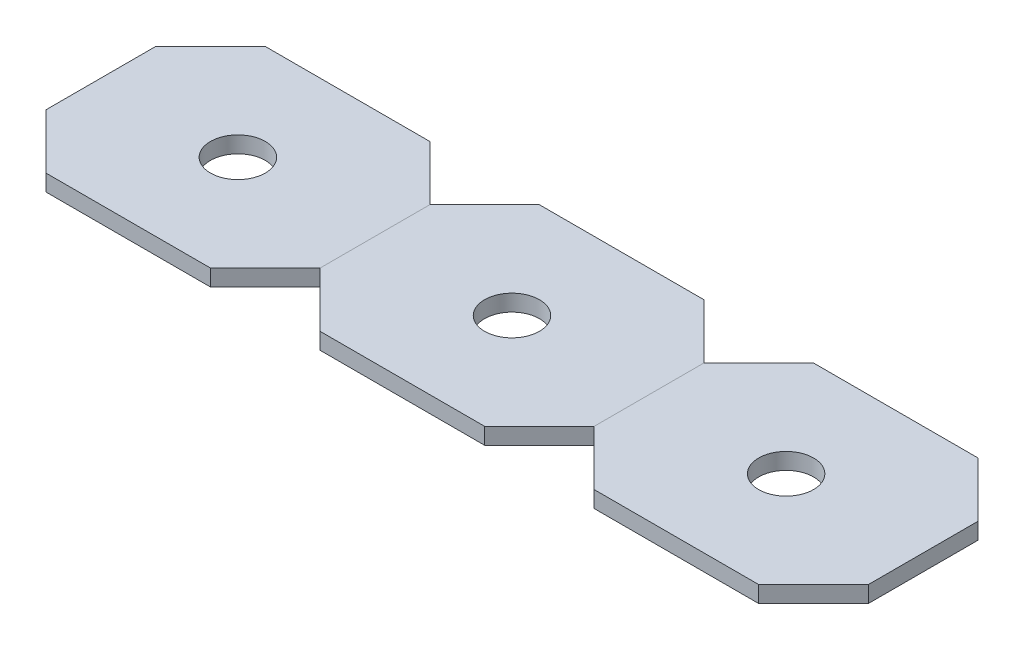
ISO-10303-21;
HEADER;
FILE_DESCRIPTION(('STEP AP214'),'2;1');
FILE_NAME('part.step','',(''),(''),'','','');
FILE_SCHEMA(('AUTOMOTIVE_DESIGN { 1 0 10303 214 1 1 1 1 }'));
ENDSEC;
DATA;
#1=APPLICATION_CONTEXT('core data for automotive mechanical design processes');
#2=APPLICATION_PROTOCOL_DEFINITION('international standard','automotive_design',2000,#1);
#3=PRODUCT_CONTEXT('',#1,'mechanical');
#4=PRODUCT('Part','Part','',(#3));
#5=PRODUCT_RELATED_PRODUCT_CATEGORY('part','',(#4));
#6=PRODUCT_DEFINITION_FORMATION('','',#4);
#7=PRODUCT_DEFINITION_CONTEXT('part definition',#1,'design');
#8=PRODUCT_DEFINITION('design','',#6,#7);
#9=PRODUCT_DEFINITION_SHAPE('','',#8);
#10=(LENGTH_UNIT() NAMED_UNIT(*) SI_UNIT(.MILLI.,.METRE.));
#11=(NAMED_UNIT(*) PLANE_ANGLE_UNIT() SI_UNIT($,.RADIAN.));
#12=(NAMED_UNIT(*) SI_UNIT($,.STERADIAN.) SOLID_ANGLE_UNIT());
#13=UNCERTAINTY_MEASURE_WITH_UNIT(LENGTH_MEASURE(1.E-05),#10,'distance_accuracy_value','');
#14=(GEOMETRIC_REPRESENTATION_CONTEXT(3) GLOBAL_UNCERTAINTY_ASSIGNED_CONTEXT((#13)) GLOBAL_UNIT_ASSIGNED_CONTEXT((#10,
#11,#12)) REPRESENTATION_CONTEXT('',''));
#15=CARTESIAN_POINT('',(0.,0.,0.));
#16=DIRECTION('',(0.,0.,1.));
#17=DIRECTION('',(1.,0.,0.));
#18=AXIS2_PLACEMENT_3D('',#15,#16,#17);
#19=CARTESIAN_POINT('',(22.5290447048375,11.8397547809117,14.1319441751472));
#20=DIRECTION('',(0.707106781186549,0.,-0.707106781186546));
#21=DIRECTION('',(-0.707106781186546,0.,-0.707106781186549));
#22=AXIS2_PLACEMENT_3D('',#19,#20,#21);
#23=PLANE('',#22);
#24=DIRECTION('',(-0.707106781186546,0.,-0.707106781186549));
#25=VECTOR('',#24,1.);
#26=CARTESIAN_POINT('',(22.5290447048375,13.3397547809117,14.1319441751472));
#27=LINE('',#26,#25);
#28=CARTESIAN_POINT('',(22.5290447048375,13.3397547809117,14.1319441751472));
#29=VERTEX_POINT('',#28);
#30=CARTESIAN_POINT('',(17.5290447048375,13.3397547809117,9.13194417514717));
#31=VERTEX_POINT('',#30);
#32=EDGE_CURVE('P0_E141',#29,#31,#27,.T.);
#33=ORIENTED_EDGE('',*,*,#32,.F.);
#34=DIRECTION('',(0.,1.,0.));
#35=VECTOR('',#34,1.);
#36=CARTESIAN_POINT('',(22.5290447048375,11.8397547809117,14.1319441751472));
#37=LINE('',#36,#35);
#38=CARTESIAN_POINT('',(22.5290447048375,11.8397547809117,14.1319441751472));
#39=VERTEX_POINT('',#38);
#40=EDGE_CURVE('P0_E13',#39,#29,#37,.T.);
#41=ORIENTED_EDGE('',*,*,#40,.F.);
#42=DIRECTION('',(-0.707106781186546,0.,-0.707106781186549));
#43=VECTOR('',#42,1.);
#44=CARTESIAN_POINT('',(22.5290447048375,11.8397547809117,14.1319441751472));
#45=LINE('',#44,#43);
#46=CARTESIAN_POINT('',(17.5290447048375,11.8397547809117,9.13194417514717));
#47=VERTEX_POINT('',#46);
#48=EDGE_CURVE('P0_E162',#39,#47,#45,.T.);
#49=ORIENTED_EDGE('',*,*,#48,.T.);
#50=DIRECTION('',(0.,1.,0.));
#51=VECTOR('',#50,1.);
#52=CARTESIAN_POINT('',(17.5290447048375,11.8397547809117,9.13194417514717));
#53=LINE('',#52,#51);
#54=EDGE_CURVE('P0_E47',#47,#31,#53,.T.);
#55=ORIENTED_EDGE('',*,*,#54,.T.);
#56=EDGE_LOOP('',(#33,#41,#49,#55));
#57=FACE_BOUND('',#56,.T.);
#58=ADVANCED_FACE('P0_F44',(#57),#23,.T.);
#59=CARTESIAN_POINT('',(22.5290447048375,11.8397547809117,24.1319441751472));
#60=DIRECTION('',(1.,0.,0.));
#61=DIRECTION('',(0.,0.,-1.));
#62=AXIS2_PLACEMENT_3D('',#59,#60,#61);
#63=PLANE('',#62);
#64=DIRECTION('',(0.,0.,-1.));
#65=VECTOR('',#64,1.);
#66=CARTESIAN_POINT('',(22.5290447048375,13.3397547809117,24.1319441751472));
#67=LINE('',#66,#65);
#68=CARTESIAN_POINT('',(22.5290447048375,13.3397547809117,24.1319441751472));
#69=VERTEX_POINT('',#68);
#70=EDGE_CURVE('P0_E160',#69,#29,#67,.T.);
#71=ORIENTED_EDGE('',*,*,#70,.F.);
#72=DIRECTION('',(0.,1.,0.));
#73=VECTOR('',#72,1.);
#74=CARTESIAN_POINT('',(22.5290447048375,11.8397547809117,24.1319441751472));
#75=LINE('',#74,#73);
#76=CARTESIAN_POINT('',(22.5290447048375,11.8397547809117,24.1319441751472));
#77=VERTEX_POINT('',#76);
#78=EDGE_CURVE('P0_E53',#77,#69,#75,.T.);
#79=ORIENTED_EDGE('',*,*,#78,.F.);
#80=DIRECTION('',(0.,0.,-1.));
#81=VECTOR('',#80,1.);
#82=CARTESIAN_POINT('',(22.5290447048375,11.8397547809117,24.1319441751472));
#83=LINE('',#82,#81);
#84=EDGE_CURVE('P0_E131',#77,#39,#83,.T.);
#85=ORIENTED_EDGE('',*,*,#84,.T.);
#86=ORIENTED_EDGE('',*,*,#40,.T.);
#87=EDGE_LOOP('',(#71,#79,#85,#86));
#88=FACE_BOUND('',#87,.T.);
#89=ADVANCED_FACE('P0_F174',(#88),#63,.T.);
#90=CARTESIAN_POINT('',(17.5290447048375,11.8397547809117,29.1319441751472));
#91=DIRECTION('',(0.707106781186546,0.,0.707106781186549));
#92=DIRECTION('',(0.707106781186549,0.,-0.707106781186546));
#93=AXIS2_PLACEMENT_3D('',#90,#91,#92);
#94=PLANE('',#93);
#95=DIRECTION('',(0.707106781186549,0.,-0.707106781186546));
#96=VECTOR('',#95,1.);
#97=CARTESIAN_POINT('',(17.5290447048375,13.3397547809117,29.1319441751472));
#98=LINE('',#97,#96);
#99=CARTESIAN_POINT('',(17.5290447048375,13.3397547809117,29.1319441751472));
#100=VERTEX_POINT('',#99);
#101=EDGE_CURVE('P0_E118',#100,#69,#98,.T.);
#102=ORIENTED_EDGE('',*,*,#101,.F.);
#103=DIRECTION('',(0.,1.,0.));
#104=VECTOR('',#103,1.);
#105=CARTESIAN_POINT('',(17.5290447048375,11.8397547809117,29.1319441751472));
#106=LINE('',#105,#104);
#107=CARTESIAN_POINT('',(17.5290447048375,11.8397547809117,29.1319441751472));
#108=VERTEX_POINT('',#107);
#109=EDGE_CURVE('P0_E113',#108,#100,#106,.T.);
#110=ORIENTED_EDGE('',*,*,#109,.F.);
#111=DIRECTION('',(0.707106781186549,0.,-0.707106781186546));
#112=VECTOR('',#111,1.);
#113=CARTESIAN_POINT('',(17.5290447048375,11.8397547809117,29.1319441751472));
#114=LINE('',#113,#112);
#115=EDGE_CURVE('P0_E116',#108,#77,#114,.T.);
#116=ORIENTED_EDGE('',*,*,#115,.T.);
#117=ORIENTED_EDGE('',*,*,#78,.T.);
#118=EDGE_LOOP('',(#102,#110,#116,#117));
#119=FACE_BOUND('',#118,.T.);
#120=ADVANCED_FACE('P0_F115',(#119),#94,.T.);
#121=CARTESIAN_POINT('',(2.52904470483748,11.8397547809117,29.1319441751472));
#122=DIRECTION('',(0.,0.,1.));
#123=DIRECTION('',(1.,0.,0.));
#124=AXIS2_PLACEMENT_3D('',#121,#122,#123);
#125=PLANE('',#124);
#126=DIRECTION('',(1.,0.,0.));
#127=VECTOR('',#126,1.);
#128=CARTESIAN_POINT('',(2.52904470483748,13.3397547809117,29.1319441751472));
#129=LINE('',#128,#127);
#130=CARTESIAN_POINT('',(2.52904470483748,13.3397547809117,29.1319441751472));
#131=VERTEX_POINT('',#130);
#132=EDGE_CURVE('P0_E157',#131,#100,#129,.T.);
#133=ORIENTED_EDGE('',*,*,#132,.F.);
#134=DIRECTION('',(0.,1.,0.));
#135=VECTOR('',#134,1.);
#136=CARTESIAN_POINT('',(2.52904470483748,11.8397547809117,29.1319441751472));
#137=LINE('',#136,#135);
#138=CARTESIAN_POINT('',(2.52904470483748,11.8397547809117,29.1319441751472));
#139=VERTEX_POINT('',#138);
#140=EDGE_CURVE('P0_E123',#139,#131,#137,.T.);
#141=ORIENTED_EDGE('',*,*,#140,.F.);
#142=DIRECTION('',(1.,0.,0.));
#143=VECTOR('',#142,1.);
#144=CARTESIAN_POINT('',(2.52904470483748,11.8397547809117,29.1319441751472));
#145=LINE('',#144,#143);
#146=EDGE_CURVE('P0_E129',#139,#108,#145,.T.);
#147=ORIENTED_EDGE('',*,*,#146,.T.);
#148=ORIENTED_EDGE('',*,*,#109,.T.);
#149=EDGE_LOOP('',(#133,#141,#147,#148));
#150=FACE_BOUND('',#149,.T.);
#151=ADVANCED_FACE('P0_F133',(#150),#125,.T.);
#152=CARTESIAN_POINT('',(-2.47095529516251,11.8397547809117,24.1319441751472));
#153=DIRECTION('',(-0.707106781186549,0.,0.707106781186546));
#154=DIRECTION('',(0.707106781186546,0.,0.707106781186549));
#155=AXIS2_PLACEMENT_3D('',#152,#153,#154);
#156=PLANE('',#155);
#157=DIRECTION('',(0.707106781186546,0.,0.707106781186549));
#158=VECTOR('',#157,1.);
#159=CARTESIAN_POINT('',(-2.47095529516251,13.3397547809117,24.1319441751472));
#160=LINE('',#159,#158);
#161=CARTESIAN_POINT('',(-2.47095529516251,13.3397547809117,24.1319441751472));
#162=VERTEX_POINT('',#161);
#163=EDGE_CURVE('P0_E154',#162,#131,#160,.T.);
#164=ORIENTED_EDGE('',*,*,#163,.F.);
#165=DIRECTION('',(0.,1.,0.));
#166=VECTOR('',#165,1.);
#167=CARTESIAN_POINT('',(-2.47095529516251,11.8397547809117,24.1319441751472));
#168=LINE('',#167,#166);
#169=CARTESIAN_POINT('',(-2.47095529516251,11.8397547809117,24.1319441751472));
#170=VERTEX_POINT('',#169);
#171=EDGE_CURVE('P0_E166',#170,#162,#168,.T.);
#172=ORIENTED_EDGE('',*,*,#171,.F.);
#173=DIRECTION('',(0.707106781186546,0.,0.707106781186549));
#174=VECTOR('',#173,1.);
#175=CARTESIAN_POINT('',(-2.47095529516251,11.8397547809117,24.1319441751472));
#176=LINE('',#175,#174);
#177=EDGE_CURVE('P0_E134',#170,#139,#176,.T.);
#178=ORIENTED_EDGE('',*,*,#177,.T.);
#179=ORIENTED_EDGE('',*,*,#140,.T.);
#180=EDGE_LOOP('',(#164,#172,#178,#179));
#181=FACE_BOUND('',#180,.T.);
#182=ADVANCED_FACE('P0_F187',(#181),#156,.T.);
#183=CARTESIAN_POINT('',(-2.47095529516252,11.8397547809117,14.1319441751472));
#184=DIRECTION('',(-1.,0.,0.));
#185=DIRECTION('',(0.,0.,1.));
#186=AXIS2_PLACEMENT_3D('',#183,#184,#185);
#187=PLANE('',#186);
#188=DIRECTION('',(0.,0.,1.));
#189=VECTOR('',#188,1.);
#190=CARTESIAN_POINT('',(-2.47095529516252,13.3397547809117,14.1319441751472));
#191=LINE('',#190,#189);
#192=CARTESIAN_POINT('',(-2.47095529516252,13.3397547809117,14.1319441751472));
#193=VERTEX_POINT('',#192);
#194=EDGE_CURVE('P0_E151',#193,#162,#191,.T.);
#195=ORIENTED_EDGE('',*,*,#194,.F.);
#196=DIRECTION('',(0.,1.,0.));
#197=VECTOR('',#196,1.);
#198=CARTESIAN_POINT('',(-2.47095529516252,11.8397547809117,14.1319441751472));
#199=LINE('',#198,#197);
#200=CARTESIAN_POINT('',(-2.47095529516252,11.8397547809117,14.1319441751472));
#201=VERTEX_POINT('',#200);
#202=EDGE_CURVE('P0_E168',#201,#193,#199,.T.);
#203=ORIENTED_EDGE('',*,*,#202,.F.);
#204=DIRECTION('',(0.,0.,1.));
#205=VECTOR('',#204,1.);
#206=CARTESIAN_POINT('',(-2.47095529516252,11.8397547809117,14.1319441751472));
#207=LINE('',#206,#205);
#208=EDGE_CURVE('P0_E136',#201,#170,#207,.T.);
#209=ORIENTED_EDGE('',*,*,#208,.T.);
#210=ORIENTED_EDGE('',*,*,#171,.T.);
#211=EDGE_LOOP('',(#195,#203,#209,#210));
#212=FACE_BOUND('',#211,.T.);
#213=ADVANCED_FACE('P0_F190',(#212),#187,.T.);
#214=CARTESIAN_POINT('',(2.5290447048375,11.8397547809117,9.13194417514717));
#215=DIRECTION('',(-0.707106781186546,0.,-0.707106781186549));
#216=DIRECTION('',(-0.707106781186549,0.,0.707106781186546));
#217=AXIS2_PLACEMENT_3D('',#214,#215,#216);
#218=PLANE('',#217);
#219=DIRECTION('',(-0.707106781186549,0.,0.707106781186546));
#220=VECTOR('',#219,1.);
#221=CARTESIAN_POINT('',(2.5290447048375,13.3397547809117,9.13194417514717));
#222=LINE('',#221,#220);
#223=CARTESIAN_POINT('',(2.5290447048375,13.3397547809117,9.13194417514717));
#224=VERTEX_POINT('',#223);
#225=EDGE_CURVE('P0_E148',#224,#193,#222,.T.);
#226=ORIENTED_EDGE('',*,*,#225,.F.);
#227=DIRECTION('',(0.,1.,0.));
#228=VECTOR('',#227,1.);
#229=CARTESIAN_POINT('',(2.5290447048375,11.8397547809117,9.13194417514717));
#230=LINE('',#229,#228);
#231=CARTESIAN_POINT('',(2.5290447048375,11.8397547809117,9.13194417514717));
#232=VERTEX_POINT('',#231);
#233=EDGE_CURVE('P0_E169',#232,#224,#230,.T.);
#234=ORIENTED_EDGE('',*,*,#233,.F.);
#235=DIRECTION('',(-0.707106781186549,0.,0.707106781186546));
#236=VECTOR('',#235,1.);
#237=CARTESIAN_POINT('',(2.5290447048375,11.8397547809117,9.13194417514717));
#238=LINE('',#237,#236);
#239=EDGE_CURVE('P0_E225',#232,#201,#238,.T.);
#240=ORIENTED_EDGE('',*,*,#239,.T.);
#241=ORIENTED_EDGE('',*,*,#202,.T.);
#242=EDGE_LOOP('',(#226,#234,#240,#241));
#243=FACE_BOUND('',#242,.T.);
#244=ADVANCED_FACE('P0_F194',(#243),#218,.T.);
#245=CARTESIAN_POINT('',(17.5290447048375,11.8397547809117,9.13194417514717));
#246=DIRECTION('',(0.,0.,-1.));
#247=DIRECTION('',(-1.,0.,0.));
#248=AXIS2_PLACEMENT_3D('',#245,#246,#247);
#249=PLANE('',#248);
#250=DIRECTION('',(-1.,0.,0.));
#251=VECTOR('',#250,1.);
#252=CARTESIAN_POINT('',(17.5290447048375,13.3397547809117,9.13194417514717));
#253=LINE('',#252,#251);
#254=EDGE_CURVE('P0_E144',#31,#224,#253,.T.);
#255=ORIENTED_EDGE('',*,*,#254,.F.);
#256=ORIENTED_EDGE('',*,*,#54,.F.);
#257=DIRECTION('',(-1.,0.,0.));
#258=VECTOR('',#257,1.);
#259=CARTESIAN_POINT('',(17.5290447048375,11.8397547809117,9.13194417514717));
#260=LINE('',#259,#258);
#261=EDGE_CURVE('P0_E223',#47,#232,#260,.T.);
#262=ORIENTED_EDGE('',*,*,#261,.T.);
#263=ORIENTED_EDGE('',*,*,#233,.T.);
#264=EDGE_LOOP('',(#255,#256,#262,#263));
#265=FACE_BOUND('',#264,.T.);
#266=ADVANCED_FACE('P0_F171',(#265),#249,.T.);
#267=CARTESIAN_POINT('',(0.,11.8397547809117,0.));
#268=DIRECTION('',(0.,1.,0.));
#269=DIRECTION('',(0.,0.,1.));
#270=AXIS2_PLACEMENT_3D('',#267,#268,#269);
#271=PLANE('',#270);
#272=CARTESIAN_POINT('',(10.0290447048375,11.8397547809117,19.1319441751472));
#273=DIRECTION('',(0.,1.,0.));
#274=DIRECTION('',(0.,0.,-1.));
#275=AXIS2_PLACEMENT_3D('',#272,#273,#274);
#276=CIRCLE('',#275,2.5);
#277=CARTESIAN_POINT('',(10.0290447048375,11.8397547809117,16.6319441751472));
#278=VERTEX_POINT('',#277);
#279=EDGE_CURVE('P0_E145',#278,#278,#276,.T.);
#280=ORIENTED_EDGE('',*,*,#279,.T.);
#281=EDGE_LOOP('',(#280));
#282=FACE_BOUND('',#281,.T.);
#283=ORIENTED_EDGE('',*,*,#48,.F.);
#284=ORIENTED_EDGE('',*,*,#84,.F.);
#285=ORIENTED_EDGE('',*,*,#115,.F.);
#286=ORIENTED_EDGE('',*,*,#146,.F.);
#287=ORIENTED_EDGE('',*,*,#177,.F.);
#288=ORIENTED_EDGE('',*,*,#208,.F.);
#289=ORIENTED_EDGE('',*,*,#239,.F.);
#290=ORIENTED_EDGE('',*,*,#261,.F.);
#291=EDGE_LOOP('',(#283,#284,#285,#286,#287,#288,#289,#290));
#292=FACE_BOUND('',#291,.T.);
#293=ADVANCED_FACE('P0_F127',(#282,#292),#271,.F.);
#294=CARTESIAN_POINT('',(0.,13.3397547809117,0.));
#295=DIRECTION('',(0.,1.,0.));
#296=DIRECTION('',(0.,0.,1.));
#297=AXIS2_PLACEMENT_3D('',#294,#295,#296);
#298=PLANE('',#297);
#299=CARTESIAN_POINT('',(10.0290447048375,13.3397547809117,19.1319441751472));
#300=DIRECTION('',(0.,1.,0.));
#301=DIRECTION('',(0.,0.,-1.));
#302=AXIS2_PLACEMENT_3D('',#299,#300,#301);
#303=CIRCLE('',#302,2.5);
#304=CARTESIAN_POINT('',(10.0290447048375,13.3397547809117,16.6319441751472));
#305=VERTEX_POINT('',#304);
#306=EDGE_CURVE('P0_E218',#305,#305,#303,.T.);
#307=ORIENTED_EDGE('',*,*,#306,.F.);
#308=EDGE_LOOP('',(#307));
#309=FACE_BOUND('',#308,.T.);
#310=ORIENTED_EDGE('',*,*,#32,.T.);
#311=ORIENTED_EDGE('',*,*,#254,.T.);
#312=ORIENTED_EDGE('',*,*,#225,.T.);
#313=ORIENTED_EDGE('',*,*,#194,.T.);
#314=ORIENTED_EDGE('',*,*,#163,.T.);
#315=ORIENTED_EDGE('',*,*,#132,.T.);
#316=ORIENTED_EDGE('',*,*,#101,.T.);
#317=ORIENTED_EDGE('',*,*,#70,.T.);
#318=EDGE_LOOP('',(#310,#311,#312,#313,#314,#315,#316,#317));
#319=FACE_BOUND('',#318,.T.);
#320=ADVANCED_FACE('P0_F173',(#309,#319),#298,.T.);
#321=CARTESIAN_POINT('',(10.0290447048375,11.8397547809117,19.1319441751472));
#322=DIRECTION('',(0.,1.,0.));
#323=DIRECTION('',(0.,0.,1.));
#324=AXIS2_PLACEMENT_3D('',#321,#322,#323);
#325=CYLINDRICAL_SURFACE('',#324,2.5);
#326=ORIENTED_EDGE('',*,*,#279,.F.);
#327=EDGE_LOOP('',(#326));
#328=FACE_BOUND('',#327,.T.);
#329=ORIENTED_EDGE('',*,*,#306,.T.);
#330=EDGE_LOOP('',(#329));
#331=FACE_BOUND('',#330,.T.);
#332=ADVANCED_FACE('P0_F206',(#328,#331),#325,.F.);
#333=CLOSED_SHELL('',(#58,#89,#120,#151,#182,#213,#244,#266,#293,#320,#332));
#334=MANIFOLD_SOLID_BREP('P0_B2',#333);
#335=CARTESIAN_POINT('',(-2.47095529516251,13.3397547809117,9.13194417514716));
#336=DIRECTION('',(-1.,0.,0.));
#337=DIRECTION('',(0.,0.,1.));
#338=AXIS2_PLACEMENT_3D('',#335,#336,#337);
#339=PLANE('',#338);
#340=DIRECTION('',(0.,0.,-1.));
#341=VECTOR('',#340,1.);
#342=CARTESIAN_POINT('',(-2.47095529516251,11.8397547809117,9.13194417514716));
#343=LINE('',#342,#341);
#344=CARTESIAN_POINT('',(-2.47095529516251,11.8397547809117,24.1319441751472));
#345=VERTEX_POINT('',#344);
#346=CARTESIAN_POINT('',(-2.47095529516251,11.8397547809117,14.1319441751472));
#347=VERTEX_POINT('',#346);
#348=EDGE_CURVE('P1_E111',#345,#347,#343,.T.);
#349=ORIENTED_EDGE('',*,*,#348,.T.);
#350=DIRECTION('',(0.,1.,0.));
#351=VECTOR('',#350,1.);
#352=CARTESIAN_POINT('',(-2.47095529516251,13.3397547809117,14.1319441751472));
#353=LINE('',#352,#351);
#354=CARTESIAN_POINT('',(-2.47095529516251,13.3397547809117,14.1319441751472));
#355=VERTEX_POINT('',#354);
#356=EDGE_CURVE('P1_E134',#347,#355,#353,.T.);
#357=ORIENTED_EDGE('',*,*,#356,.T.);
#358=DIRECTION('',(0.,0.,-1.));
#359=VECTOR('',#358,1.);
#360=CARTESIAN_POINT('',(-2.47095529516251,13.3397547809117,9.13194417514716));
#361=LINE('',#360,#359);
#362=CARTESIAN_POINT('',(-2.47095529516251,13.3397547809117,24.1319441751472));
#363=VERTEX_POINT('',#362);
#364=EDGE_CURVE('P1_E109',#363,#355,#361,.T.);
#365=ORIENTED_EDGE('',*,*,#364,.F.);
#366=DIRECTION('',(0.,-1.,0.));
#367=VECTOR('',#366,1.);
#368=CARTESIAN_POINT('',(-2.47095529516251,13.3397547809117,24.1319441751472));
#369=LINE('',#368,#367);
#370=EDGE_CURVE('P1_E131',#363,#345,#369,.T.);
#371=ORIENTED_EDGE('',*,*,#370,.T.);
#372=EDGE_LOOP('',(#349,#357,#365,#371));
#373=FACE_BOUND('',#372,.T.);
#374=ADVANCED_FACE('P1_F16',(#373),#339,.F.);
#375=CARTESIAN_POINT('',(-27.4709552951625,13.3397547809117,9.13194417514716));
#376=DIRECTION('',(0.,0.,1.));
#377=DIRECTION('',(1.,0.,0.));
#378=AXIS2_PLACEMENT_3D('',#375,#376,#377);
#379=PLANE('',#378);
#380=DIRECTION('',(-1.,0.,0.));
#381=VECTOR('',#380,1.);
#382=CARTESIAN_POINT('',(-27.4709552951625,11.8397547809117,9.13194417514716));
#383=LINE('',#382,#381);
#384=CARTESIAN_POINT('',(-7.47095529516251,11.8397547809117,9.13194417514716));
#385=VERTEX_POINT('',#384);
#386=CARTESIAN_POINT('',(-22.4709552951625,11.8397547809117,9.13194417514716));
#387=VERTEX_POINT('',#386);
#388=EDGE_CURVE('P1_E107',#385,#387,#383,.T.);
#389=ORIENTED_EDGE('',*,*,#388,.T.);
#390=DIRECTION('',(0.,1.,0.));
#391=VECTOR('',#390,1.);
#392=CARTESIAN_POINT('',(-22.4709552951625,13.3397547809117,9.13194417514716));
#393=LINE('',#392,#391);
#394=CARTESIAN_POINT('',(-22.4709552951625,13.3397547809117,9.13194417514716));
#395=VERTEX_POINT('',#394);
#396=EDGE_CURVE('P1_E86',#387,#395,#393,.T.);
#397=ORIENTED_EDGE('',*,*,#396,.T.);
#398=DIRECTION('',(-1.,0.,0.));
#399=VECTOR('',#398,1.);
#400=CARTESIAN_POINT('',(-27.4709552951625,13.3397547809117,9.13194417514716));
#401=LINE('',#400,#399);
#402=CARTESIAN_POINT('',(-7.47095529516251,13.3397547809117,9.13194417514716));
#403=VERTEX_POINT('',#402);
#404=EDGE_CURVE('P1_E150',#403,#395,#401,.T.);
#405=ORIENTED_EDGE('',*,*,#404,.F.);
#406=DIRECTION('',(0.,-1.,0.));
#407=VECTOR('',#406,1.);
#408=CARTESIAN_POINT('',(-7.47095529516251,13.3397547809117,9.13194417514716));
#409=LINE('',#408,#407);
#410=EDGE_CURVE('P1_E91',#403,#385,#409,.T.);
#411=ORIENTED_EDGE('',*,*,#410,.T.);
#412=EDGE_LOOP('',(#389,#397,#405,#411));
#413=FACE_BOUND('',#412,.T.);
#414=ADVANCED_FACE('P1_F174',(#413),#379,.F.);
#415=CARTESIAN_POINT('',(-27.4709552951625,13.3397547809117,9.13194417514716));
#416=DIRECTION('',(1.,0.,0.));
#417=DIRECTION('',(0.,0.,-1.));
#418=AXIS2_PLACEMENT_3D('',#415,#416,#417);
#419=PLANE('',#418);
#420=DIRECTION('',(0.,0.,1.));
#421=VECTOR('',#420,1.);
#422=CARTESIAN_POINT('',(-27.4709552951625,13.3397547809117,9.13194417514716));
#423=LINE('',#422,#421);
#424=CARTESIAN_POINT('',(-27.4709552951625,13.3397547809117,14.1319441751472));
#425=VERTEX_POINT('',#424);
#426=CARTESIAN_POINT('',(-27.4709552951625,13.3397547809117,24.1319441751472));
#427=VERTEX_POINT('',#426);
#428=EDGE_CURVE('P1_E100',#425,#427,#423,.T.);
#429=ORIENTED_EDGE('',*,*,#428,.F.);
#430=DIRECTION('',(0.,-1.,0.));
#431=VECTOR('',#430,1.);
#432=CARTESIAN_POINT('',(-27.4709552951625,13.3397547809117,14.1319441751472));
#433=LINE('',#432,#431);
#434=CARTESIAN_POINT('',(-27.4709552951625,11.8397547809117,14.1319441751472));
#435=VERTEX_POINT('',#434);
#436=EDGE_CURVE('P1_E85',#425,#435,#433,.T.);
#437=ORIENTED_EDGE('',*,*,#436,.T.);
#438=DIRECTION('',(0.,0.,1.));
#439=VECTOR('',#438,1.);
#440=CARTESIAN_POINT('',(-27.4709552951625,11.8397547809117,9.13194417514716));
#441=LINE('',#440,#439);
#442=CARTESIAN_POINT('',(-27.4709552951625,11.8397547809117,24.1319441751472));
#443=VERTEX_POINT('',#442);
#444=EDGE_CURVE('P1_E98',#435,#443,#441,.T.);
#445=ORIENTED_EDGE('',*,*,#444,.T.);
#446=DIRECTION('',(0.,1.,0.));
#447=VECTOR('',#446,1.);
#448=CARTESIAN_POINT('',(-27.4709552951625,13.3397547809117,24.1319441751472));
#449=LINE('',#448,#447);
#450=EDGE_CURVE('P1_E102',#443,#427,#449,.T.);
#451=ORIENTED_EDGE('',*,*,#450,.T.);
#452=EDGE_LOOP('',(#429,#437,#445,#451));
#453=FACE_BOUND('',#452,.T.);
#454=ADVANCED_FACE('P1_F97',(#453),#419,.F.);
#455=CARTESIAN_POINT('',(-27.4709552951625,13.3397547809117,29.1319441751472));
#456=DIRECTION('',(0.,0.,-1.));
#457=DIRECTION('',(-1.,0.,0.));
#458=AXIS2_PLACEMENT_3D('',#455,#456,#457);
#459=PLANE('',#458);
#460=DIRECTION('',(1.,0.,0.));
#461=VECTOR('',#460,1.);
#462=CARTESIAN_POINT('',(-27.4709552951625,11.8397547809117,29.1319441751472));
#463=LINE('',#462,#461);
#464=CARTESIAN_POINT('',(-22.4709552951625,11.8397547809117,29.1319441751472));
#465=VERTEX_POINT('',#464);
#466=CARTESIAN_POINT('',(-7.47095529516253,11.8397547809117,29.1319441751472));
#467=VERTEX_POINT('',#466);
#468=EDGE_CURVE('P1_E106',#465,#467,#463,.T.);
#469=ORIENTED_EDGE('',*,*,#468,.T.);
#470=DIRECTION('',(0.,1.,0.));
#471=VECTOR('',#470,1.);
#472=CARTESIAN_POINT('',(-7.47095529516253,13.3397547809117,29.1319441751472));
#473=LINE('',#472,#471);
#474=CARTESIAN_POINT('',(-7.47095529516253,13.3397547809117,29.1319441751472));
#475=VERTEX_POINT('',#474);
#476=EDGE_CURVE('P1_E11',#467,#475,#473,.T.);
#477=ORIENTED_EDGE('',*,*,#476,.T.);
#478=DIRECTION('',(1.,0.,0.));
#479=VECTOR('',#478,1.);
#480=CARTESIAN_POINT('',(-27.4709552951625,13.3397547809117,29.1319441751472));
#481=LINE('',#480,#479);
#482=CARTESIAN_POINT('',(-22.4709552951625,13.3397547809117,29.1319441751472));
#483=VERTEX_POINT('',#482);
#484=EDGE_CURVE('P1_E115',#483,#475,#481,.T.);
#485=ORIENTED_EDGE('',*,*,#484,.F.);
#486=DIRECTION('',(0.,-1.,0.));
#487=VECTOR('',#486,1.);
#488=CARTESIAN_POINT('',(-22.4709552951625,13.3397547809117,29.1319441751472));
#489=LINE('',#488,#487);
#490=EDGE_CURVE('P1_E24',#483,#465,#489,.T.);
#491=ORIENTED_EDGE('',*,*,#490,.T.);
#492=EDGE_LOOP('',(#469,#477,#485,#491));
#493=FACE_BOUND('',#492,.T.);
#494=ADVANCED_FACE('P1_F137',(#493),#459,.F.);
#495=CARTESIAN_POINT('',(-14.9709552951625,13.3397547809117,19.1319441751472));
#496=DIRECTION('',(0.,1.,0.));
#497=DIRECTION('',(0.,0.,1.));
#498=AXIS2_PLACEMENT_3D('',#495,#496,#497);
#499=PLANE('',#498);
#500=CARTESIAN_POINT('',(-14.9709552951625,13.3397547809117,19.1319441751472));
#501=DIRECTION('',(0.,1.,0.));
#502=DIRECTION('',(0.,0.,1.));
#503=AXIS2_PLACEMENT_3D('',#500,#501,#502);
#504=CIRCLE('',#503,2.5);
#505=CARTESIAN_POINT('',(-14.9709552951625,13.3397547809117,21.6319441751472));
#506=VERTEX_POINT('',#505);
#507=EDGE_CURVE('P1_E155',#506,#506,#504,.T.);
#508=ORIENTED_EDGE('',*,*,#507,.F.);
#509=EDGE_LOOP('',(#508));
#510=FACE_BOUND('',#509,.T.);
#511=ORIENTED_EDGE('',*,*,#404,.T.);
#512=DIRECTION('',(0.707106781186549,0.,-0.707106781186546));
#513=VECTOR('',#512,1.);
#514=CARTESIAN_POINT('',(-23.7209552951625,13.3397547809117,10.3819441751471));
#515=LINE('',#514,#513);
#516=EDGE_CURVE('P1_E129',#395,#425,#515,.F.);
#517=ORIENTED_EDGE('',*,*,#516,.T.);
#518=ORIENTED_EDGE('',*,*,#428,.T.);
#519=DIRECTION('',(-0.707106781186546,0.,-0.707106781186549));
#520=VECTOR('',#519,1.);
#521=CARTESIAN_POINT('',(-23.7209552951625,13.3397547809117,27.8819441751472));
#522=LINE('',#521,#520);
#523=EDGE_CURVE('P1_E36',#427,#483,#522,.F.);
#524=ORIENTED_EDGE('',*,*,#523,.T.);
#525=ORIENTED_EDGE('',*,*,#484,.T.);
#526=DIRECTION('',(-0.707106781186549,0.,0.707106781186546));
#527=VECTOR('',#526,1.);
#528=CARTESIAN_POINT('',(-6.22095529516254,13.3397547809117,27.8819441751472));
#529=LINE('',#528,#527);
#530=EDGE_CURVE('P1_E125',#475,#363,#529,.F.);
#531=ORIENTED_EDGE('',*,*,#530,.T.);
#532=ORIENTED_EDGE('',*,*,#364,.T.);
#533=DIRECTION('',(0.707106781186546,0.,0.707106781186549));
#534=VECTOR('',#533,1.);
#535=CARTESIAN_POINT('',(-6.22095529516249,13.3397547809117,10.3819441751472));
#536=LINE('',#535,#534);
#537=EDGE_CURVE('P1_E127',#355,#403,#536,.F.);
#538=ORIENTED_EDGE('',*,*,#537,.T.);
#539=EDGE_LOOP('',(#511,#517,#518,#524,#525,#531,#532,#538));
#540=FACE_BOUND('',#539,.T.);
#541=ADVANCED_FACE('P1_F168',(#510,#540),#499,.T.);
#542=CARTESIAN_POINT('',(-14.9709552951625,11.8397547809117,19.1319441751472));
#543=DIRECTION('',(0.,1.,0.));
#544=DIRECTION('',(0.,0.,1.));
#545=AXIS2_PLACEMENT_3D('',#542,#543,#544);
#546=PLANE('',#545);
#547=CARTESIAN_POINT('',(-14.9709552951625,11.8397547809117,19.1319441751472));
#548=DIRECTION('',(0.,1.,0.));
#549=DIRECTION('',(0.,0.,1.));
#550=AXIS2_PLACEMENT_3D('',#547,#548,#549);
#551=CIRCLE('',#550,2.5);
#552=CARTESIAN_POINT('',(-14.9709552951625,11.8397547809117,21.6319441751472));
#553=VERTEX_POINT('',#552);
#554=EDGE_CURVE('P1_E159',#553,#553,#551,.T.);
#555=ORIENTED_EDGE('',*,*,#554,.T.);
#556=EDGE_LOOP('',(#555));
#557=FACE_BOUND('',#556,.T.);
#558=ORIENTED_EDGE('',*,*,#444,.F.);
#559=DIRECTION('',(-0.707106781186549,0.,0.707106781186546));
#560=VECTOR('',#559,1.);
#561=CARTESIAN_POINT('',(-27.4709552951625,11.8397547809117,14.1319441751472));
#562=LINE('',#561,#560);
#563=EDGE_CURVE('P1_E81',#435,#387,#562,.F.);
#564=ORIENTED_EDGE('',*,*,#563,.T.);
#565=ORIENTED_EDGE('',*,*,#388,.F.);
#566=DIRECTION('',(-0.707106781186546,0.,-0.707106781186549));
#567=VECTOR('',#566,1.);
#568=CARTESIAN_POINT('',(-7.47095529516251,11.8397547809117,9.13194417514716));
#569=LINE('',#568,#567);
#570=EDGE_CURVE('P1_E92',#385,#347,#569,.F.);
#571=ORIENTED_EDGE('',*,*,#570,.T.);
#572=ORIENTED_EDGE('',*,*,#348,.F.);
#573=DIRECTION('',(0.707106781186549,0.,-0.707106781186546));
#574=VECTOR('',#573,1.);
#575=CARTESIAN_POINT('',(-2.47095529516251,11.8397547809117,24.1319441751472));
#576=LINE('',#575,#574);
#577=EDGE_CURVE('P1_E118',#345,#467,#576,.F.);
#578=ORIENTED_EDGE('',*,*,#577,.T.);
#579=ORIENTED_EDGE('',*,*,#468,.F.);
#580=DIRECTION('',(0.707106781186546,0.,0.707106781186549));
#581=VECTOR('',#580,1.);
#582=CARTESIAN_POINT('',(-22.4709552951625,11.8397547809117,29.1319441751472));
#583=LINE('',#582,#581);
#584=EDGE_CURVE('P1_E101',#465,#443,#583,.F.);
#585=ORIENTED_EDGE('',*,*,#584,.T.);
#586=EDGE_LOOP('',(#558,#564,#565,#571,#572,#578,#579,#585));
#587=FACE_BOUND('',#586,.T.);
#588=ADVANCED_FACE('P1_F104',(#557,#587),#546,.F.);
#589=CARTESIAN_POINT('',(-27.4709552951625,13.3397547809117,14.1319441751472));
#590=DIRECTION('',(0.707106781186546,0.,0.707106781186549));
#591=DIRECTION('',(0.,-1.,0.));
#592=AXIS2_PLACEMENT_3D('',#589,#590,#591);
#593=PLANE('',#592);
#594=ORIENTED_EDGE('',*,*,#516,.F.);
#595=ORIENTED_EDGE('',*,*,#396,.F.);
#596=ORIENTED_EDGE('',*,*,#563,.F.);
#597=ORIENTED_EDGE('',*,*,#436,.F.);
#598=EDGE_LOOP('',(#594,#595,#596,#597));
#599=FACE_BOUND('',#598,.T.);
#600=ADVANCED_FACE('P1_F84',(#599),#593,.F.);
#601=CARTESIAN_POINT('',(-7.47095529516251,13.3397547809117,9.13194417514716));
#602=DIRECTION('',(-0.707106781186549,0.,0.707106781186546));
#603=DIRECTION('',(0.,-1.,0.));
#604=AXIS2_PLACEMENT_3D('',#601,#602,#603);
#605=PLANE('',#604);
#606=ORIENTED_EDGE('',*,*,#537,.F.);
#607=ORIENTED_EDGE('',*,*,#356,.F.);
#608=ORIENTED_EDGE('',*,*,#570,.F.);
#609=ORIENTED_EDGE('',*,*,#410,.F.);
#610=EDGE_LOOP('',(#606,#607,#608,#609));
#611=FACE_BOUND('',#610,.T.);
#612=ADVANCED_FACE('P1_F176',(#611),#605,.F.);
#613=CARTESIAN_POINT('',(-2.47095529516251,13.3397547809117,24.1319441751472));
#614=DIRECTION('',(-0.707106781186546,0.,-0.707106781186549));
#615=DIRECTION('',(0.,-1.,0.));
#616=AXIS2_PLACEMENT_3D('',#613,#614,#615);
#617=PLANE('',#616);
#618=ORIENTED_EDGE('',*,*,#530,.F.);
#619=ORIENTED_EDGE('',*,*,#476,.F.);
#620=ORIENTED_EDGE('',*,*,#577,.F.);
#621=ORIENTED_EDGE('',*,*,#370,.F.);
#622=EDGE_LOOP('',(#618,#619,#620,#621));
#623=FACE_BOUND('',#622,.T.);
#624=ADVANCED_FACE('P1_F144',(#623),#617,.F.);
#625=CARTESIAN_POINT('',(-22.4709552951625,13.3397547809117,29.1319441751472));
#626=DIRECTION('',(0.707106781186549,0.,-0.707106781186546));
#627=DIRECTION('',(0.,-1.,0.));
#628=AXIS2_PLACEMENT_3D('',#625,#626,#627);
#629=PLANE('',#628);
#630=ORIENTED_EDGE('',*,*,#523,.F.);
#631=ORIENTED_EDGE('',*,*,#450,.F.);
#632=ORIENTED_EDGE('',*,*,#584,.F.);
#633=ORIENTED_EDGE('',*,*,#490,.F.);
#634=EDGE_LOOP('',(#630,#631,#632,#633));
#635=FACE_BOUND('',#634,.T.);
#636=ADVANCED_FACE('P1_F18',(#635),#629,.F.);
#637=CARTESIAN_POINT('',(-14.9709552951625,11.8397547809117,19.1319441751472));
#638=DIRECTION('',(0.,1.,0.));
#639=DIRECTION('',(0.,0.,1.));
#640=AXIS2_PLACEMENT_3D('',#637,#638,#639);
#641=CYLINDRICAL_SURFACE('',#640,2.5);
#642=ORIENTED_EDGE('',*,*,#554,.F.);
#643=EDGE_LOOP('',(#642));
#644=FACE_BOUND('',#643,.T.);
#645=ORIENTED_EDGE('',*,*,#507,.T.);
#646=EDGE_LOOP('',(#645));
#647=FACE_BOUND('',#646,.T.);
#648=ADVANCED_FACE('P1_F166',(#644,#647),#641,.F.);
#649=CLOSED_SHELL('',(#374,#414,#454,#494,#541,#588,#600,#612,#624,#636,#648));
#650=MANIFOLD_SOLID_BREP('P1_B1',#649);
#651=CARTESIAN_POINT('',(47.5290447048375,13.3397547809117,9.13194417514717));
#652=DIRECTION('',(-1.,0.,0.));
#653=DIRECTION('',(0.,0.,1.));
#654=AXIS2_PLACEMENT_3D('',#651,#652,#653);
#655=PLANE('',#654);
#656=DIRECTION('',(0.,0.,-1.));
#657=VECTOR('',#656,1.);
#658=CARTESIAN_POINT('',(47.5290447048375,11.8397547809117,9.13194417514717));
#659=LINE('',#658,#657);
#660=CARTESIAN_POINT('',(47.5290447048375,11.8397547809117,24.1319441751472));
#661=VERTEX_POINT('',#660);
#662=CARTESIAN_POINT('',(47.5290447048375,11.8397547809117,14.1319441751472));
#663=VERTEX_POINT('',#662);
#664=EDGE_CURVE('P2_E111',#661,#663,#659,.T.);
#665=ORIENTED_EDGE('',*,*,#664,.T.);
#666=DIRECTION('',(0.,1.,0.));
#667=VECTOR('',#666,1.);
#668=CARTESIAN_POINT('',(47.5290447048375,13.3397547809117,14.1319441751472));
#669=LINE('',#668,#667);
#670=CARTESIAN_POINT('',(47.5290447048375,13.3397547809117,14.1319441751472));
#671=VERTEX_POINT('',#670);
#672=EDGE_CURVE('P2_E134',#663,#671,#669,.T.);
#673=ORIENTED_EDGE('',*,*,#672,.T.);
#674=DIRECTION('',(0.,0.,-1.));
#675=VECTOR('',#674,1.);
#676=CARTESIAN_POINT('',(47.5290447048375,13.3397547809117,9.13194417514717));
#677=LINE('',#676,#675);
#678=CARTESIAN_POINT('',(47.5290447048375,13.3397547809117,24.1319441751472));
#679=VERTEX_POINT('',#678);
#680=EDGE_CURVE('P2_E109',#679,#671,#677,.T.);
#681=ORIENTED_EDGE('',*,*,#680,.F.);
#682=DIRECTION('',(0.,-1.,0.));
#683=VECTOR('',#682,1.);
#684=CARTESIAN_POINT('',(47.5290447048375,13.3397547809117,24.1319441751472));
#685=LINE('',#684,#683);
#686=EDGE_CURVE('P2_E131',#679,#661,#685,.T.);
#687=ORIENTED_EDGE('',*,*,#686,.T.);
#688=EDGE_LOOP('',(#665,#673,#681,#687));
#689=FACE_BOUND('',#688,.T.);
#690=ADVANCED_FACE('P2_F16',(#689),#655,.F.);
#691=CARTESIAN_POINT('',(22.5290447048375,13.3397547809117,9.13194417514717));
#692=DIRECTION('',(0.,0.,1.));
#693=DIRECTION('',(1.,0.,0.));
#694=AXIS2_PLACEMENT_3D('',#691,#692,#693);
#695=PLANE('',#694);
#696=DIRECTION('',(-1.,0.,0.));
#697=VECTOR('',#696,1.);
#698=CARTESIAN_POINT('',(22.5290447048375,11.8397547809117,9.13194417514717));
#699=LINE('',#698,#697);
#700=CARTESIAN_POINT('',(42.5290447048375,11.8397547809117,9.13194417514717));
#701=VERTEX_POINT('',#700);
#702=CARTESIAN_POINT('',(27.5290447048375,11.8397547809117,9.13194417514717));
#703=VERTEX_POINT('',#702);
#704=EDGE_CURVE('P2_E107',#701,#703,#699,.T.);
#705=ORIENTED_EDGE('',*,*,#704,.T.);
#706=DIRECTION('',(0.,1.,0.));
#707=VECTOR('',#706,1.);
#708=CARTESIAN_POINT('',(27.5290447048375,13.3397547809117,9.13194417514717));
#709=LINE('',#708,#707);
#710=CARTESIAN_POINT('',(27.5290447048375,13.3397547809117,9.13194417514717));
#711=VERTEX_POINT('',#710);
#712=EDGE_CURVE('P2_E86',#703,#711,#709,.T.);
#713=ORIENTED_EDGE('',*,*,#712,.T.);
#714=DIRECTION('',(-1.,0.,0.));
#715=VECTOR('',#714,1.);
#716=CARTESIAN_POINT('',(22.5290447048375,13.3397547809117,9.13194417514717));
#717=LINE('',#716,#715);
#718=CARTESIAN_POINT('',(42.5290447048375,13.3397547809117,9.13194417514717));
#719=VERTEX_POINT('',#718);
#720=EDGE_CURVE('P2_E150',#719,#711,#717,.T.);
#721=ORIENTED_EDGE('',*,*,#720,.F.);
#722=DIRECTION('',(0.,-1.,0.));
#723=VECTOR('',#722,1.);
#724=CARTESIAN_POINT('',(42.5290447048375,13.3397547809117,9.13194417514717));
#725=LINE('',#724,#723);
#726=EDGE_CURVE('P2_E91',#719,#701,#725,.T.);
#727=ORIENTED_EDGE('',*,*,#726,.T.);
#728=EDGE_LOOP('',(#705,#713,#721,#727));
#729=FACE_BOUND('',#728,.T.);
#730=ADVANCED_FACE('P2_F174',(#729),#695,.F.);
#731=CARTESIAN_POINT('',(22.5290447048375,13.3397547809117,9.13194417514717));
#732=DIRECTION('',(1.,0.,0.));
#733=DIRECTION('',(0.,0.,-1.));
#734=AXIS2_PLACEMENT_3D('',#731,#732,#733);
#735=PLANE('',#734);
#736=DIRECTION('',(0.,0.,1.));
#737=VECTOR('',#736,1.);
#738=CARTESIAN_POINT('',(22.5290447048375,13.3397547809117,9.13194417514717));
#739=LINE('',#738,#737);
#740=CARTESIAN_POINT('',(22.5290447048375,13.3397547809117,14.1319441751472));
#741=VERTEX_POINT('',#740);
#742=CARTESIAN_POINT('',(22.5290447048375,13.3397547809117,24.1319441751472));
#743=VERTEX_POINT('',#742);
#744=EDGE_CURVE('P2_E100',#741,#743,#739,.T.);
#745=ORIENTED_EDGE('',*,*,#744,.F.);
#746=DIRECTION('',(0.,-1.,0.));
#747=VECTOR('',#746,1.);
#748=CARTESIAN_POINT('',(22.5290447048375,13.3397547809117,14.1319441751472));
#749=LINE('',#748,#747);
#750=CARTESIAN_POINT('',(22.5290447048375,11.8397547809117,14.1319441751472));
#751=VERTEX_POINT('',#750);
#752=EDGE_CURVE('P2_E85',#741,#751,#749,.T.);
#753=ORIENTED_EDGE('',*,*,#752,.T.);
#754=DIRECTION('',(0.,0.,1.));
#755=VECTOR('',#754,1.);
#756=CARTESIAN_POINT('',(22.5290447048375,11.8397547809117,9.13194417514717));
#757=LINE('',#756,#755);
#758=CARTESIAN_POINT('',(22.5290447048375,11.8397547809117,24.1319441751472));
#759=VERTEX_POINT('',#758);
#760=EDGE_CURVE('P2_E98',#751,#759,#757,.T.);
#761=ORIENTED_EDGE('',*,*,#760,.T.);
#762=DIRECTION('',(0.,1.,0.));
#763=VECTOR('',#762,1.);
#764=CARTESIAN_POINT('',(22.5290447048375,13.3397547809117,24.1319441751472));
#765=LINE('',#764,#763);
#766=EDGE_CURVE('P2_E102',#759,#743,#765,.T.);
#767=ORIENTED_EDGE('',*,*,#766,.T.);
#768=EDGE_LOOP('',(#745,#753,#761,#767));
#769=FACE_BOUND('',#768,.T.);
#770=ADVANCED_FACE('P2_F97',(#769),#735,.F.);
#771=CARTESIAN_POINT('',(22.5290447048375,13.3397547809117,29.1319441751472));
#772=DIRECTION('',(0.,0.,-1.));
#773=DIRECTION('',(-1.,0.,0.));
#774=AXIS2_PLACEMENT_3D('',#771,#772,#773);
#775=PLANE('',#774);
#776=DIRECTION('',(1.,0.,0.));
#777=VECTOR('',#776,1.);
#778=CARTESIAN_POINT('',(22.5290447048375,11.8397547809117,29.1319441751472));
#779=LINE('',#778,#777);
#780=CARTESIAN_POINT('',(27.5290447048375,11.8397547809117,29.1319441751472));
#781=VERTEX_POINT('',#780);
#782=CARTESIAN_POINT('',(42.5290447048375,11.8397547809117,29.1319441751472));
#783=VERTEX_POINT('',#782);
#784=EDGE_CURVE('P2_E106',#781,#783,#779,.T.);
#785=ORIENTED_EDGE('',*,*,#784,.T.);
#786=DIRECTION('',(0.,1.,0.));
#787=VECTOR('',#786,1.);
#788=CARTESIAN_POINT('',(42.5290447048375,13.3397547809117,29.1319441751472));
#789=LINE('',#788,#787);
#790=CARTESIAN_POINT('',(42.5290447048375,13.3397547809117,29.1319441751472));
#791=VERTEX_POINT('',#790);
#792=EDGE_CURVE('P2_E11',#783,#791,#789,.T.);
#793=ORIENTED_EDGE('',*,*,#792,.T.);
#794=DIRECTION('',(1.,0.,0.));
#795=VECTOR('',#794,1.);
#796=CARTESIAN_POINT('',(22.5290447048375,13.3397547809117,29.1319441751472));
#797=LINE('',#796,#795);
#798=CARTESIAN_POINT('',(27.5290447048375,13.3397547809117,29.1319441751472));
#799=VERTEX_POINT('',#798);
#800=EDGE_CURVE('P2_E115',#799,#791,#797,.T.);
#801=ORIENTED_EDGE('',*,*,#800,.F.);
#802=DIRECTION('',(0.,-1.,0.));
#803=VECTOR('',#802,1.);
#804=CARTESIAN_POINT('',(27.5290447048375,13.3397547809117,29.1319441751472));
#805=LINE('',#804,#803);
#806=EDGE_CURVE('P2_E24',#799,#781,#805,.T.);
#807=ORIENTED_EDGE('',*,*,#806,.T.);
#808=EDGE_LOOP('',(#785,#793,#801,#807));
#809=FACE_BOUND('',#808,.T.);
#810=ADVANCED_FACE('P2_F137',(#809),#775,.F.);
#811=CARTESIAN_POINT('',(35.0290447048375,13.3397547809117,19.1319441751472));
#812=DIRECTION('',(0.,1.,0.));
#813=DIRECTION('',(0.,0.,1.));
#814=AXIS2_PLACEMENT_3D('',#811,#812,#813);
#815=PLANE('',#814);
#816=CARTESIAN_POINT('',(35.0290447048375,13.3397547809117,19.1319441751472));
#817=DIRECTION('',(0.,1.,0.));
#818=DIRECTION('',(0.,0.,1.));
#819=AXIS2_PLACEMENT_3D('',#816,#817,#818);
#820=CIRCLE('',#819,2.5);
#821=CARTESIAN_POINT('',(35.0290447048375,13.3397547809117,21.6319441751472));
#822=VERTEX_POINT('',#821);
#823=EDGE_CURVE('P2_E155',#822,#822,#820,.T.);
#824=ORIENTED_EDGE('',*,*,#823,.F.);
#825=EDGE_LOOP('',(#824));
#826=FACE_BOUND('',#825,.T.);
#827=ORIENTED_EDGE('',*,*,#720,.T.);
#828=DIRECTION('',(0.707106781186549,0.,-0.707106781186546));
#829=VECTOR('',#828,1.);
#830=CARTESIAN_POINT('',(26.2790447048375,13.3397547809117,10.3819441751472));
#831=LINE('',#830,#829);
#832=EDGE_CURVE('P2_E129',#711,#741,#831,.F.);
#833=ORIENTED_EDGE('',*,*,#832,.T.);
#834=ORIENTED_EDGE('',*,*,#744,.T.);
#835=DIRECTION('',(-0.707106781186546,0.,-0.707106781186549));
#836=VECTOR('',#835,1.);
#837=CARTESIAN_POINT('',(26.2790447048375,13.3397547809117,27.8819441751472));
#838=LINE('',#837,#836);
#839=EDGE_CURVE('P2_E36',#743,#799,#838,.F.);
#840=ORIENTED_EDGE('',*,*,#839,.T.);
#841=ORIENTED_EDGE('',*,*,#800,.T.);
#842=DIRECTION('',(-0.707106781186549,0.,0.707106781186546));
#843=VECTOR('',#842,1.);
#844=CARTESIAN_POINT('',(43.7790447048375,13.3397547809117,27.8819441751472));
#845=LINE('',#844,#843);
#846=EDGE_CURVE('P2_E125',#791,#679,#845,.F.);
#847=ORIENTED_EDGE('',*,*,#846,.T.);
#848=ORIENTED_EDGE('',*,*,#680,.T.);
#849=DIRECTION('',(0.707106781186546,0.,0.707106781186549));
#850=VECTOR('',#849,1.);
#851=CARTESIAN_POINT('',(43.7790447048375,13.3397547809117,10.3819441751472));
#852=LINE('',#851,#850);
#853=EDGE_CURVE('P2_E127',#671,#719,#852,.F.);
#854=ORIENTED_EDGE('',*,*,#853,.T.);
#855=EDGE_LOOP('',(#827,#833,#834,#840,#841,#847,#848,#854));
#856=FACE_BOUND('',#855,.T.);
#857=ADVANCED_FACE('P2_F168',(#826,#856),#815,.T.);
#858=CARTESIAN_POINT('',(35.0290447048375,11.8397547809117,19.1319441751472));
#859=DIRECTION('',(0.,1.,0.));
#860=DIRECTION('',(0.,0.,1.));
#861=AXIS2_PLACEMENT_3D('',#858,#859,#860);
#862=PLANE('',#861);
#863=CARTESIAN_POINT('',(35.0290447048375,11.8397547809117,19.1319441751472));
#864=DIRECTION('',(0.,1.,0.));
#865=DIRECTION('',(0.,0.,1.));
#866=AXIS2_PLACEMENT_3D('',#863,#864,#865);
#867=CIRCLE('',#866,2.5);
#868=CARTESIAN_POINT('',(35.0290447048375,11.8397547809117,21.6319441751472));
#869=VERTEX_POINT('',#868);
#870=EDGE_CURVE('P2_E159',#869,#869,#867,.T.);
#871=ORIENTED_EDGE('',*,*,#870,.T.);
#872=EDGE_LOOP('',(#871));
#873=FACE_BOUND('',#872,.T.);
#874=ORIENTED_EDGE('',*,*,#760,.F.);
#875=DIRECTION('',(-0.707106781186549,0.,0.707106781186546));
#876=VECTOR('',#875,1.);
#877=CARTESIAN_POINT('',(22.5290447048375,11.8397547809117,14.1319441751472));
#878=LINE('',#877,#876);
#879=EDGE_CURVE('P2_E81',#751,#703,#878,.F.);
#880=ORIENTED_EDGE('',*,*,#879,.T.);
#881=ORIENTED_EDGE('',*,*,#704,.F.);
#882=DIRECTION('',(-0.707106781186546,0.,-0.707106781186549));
#883=VECTOR('',#882,1.);
#884=CARTESIAN_POINT('',(42.5290447048375,11.8397547809117,9.13194417514717));
#885=LINE('',#884,#883);
#886=EDGE_CURVE('P2_E92',#701,#663,#885,.F.);
#887=ORIENTED_EDGE('',*,*,#886,.T.);
#888=ORIENTED_EDGE('',*,*,#664,.F.);
#889=DIRECTION('',(0.707106781186549,0.,-0.707106781186546));
#890=VECTOR('',#889,1.);
#891=CARTESIAN_POINT('',(47.5290447048375,11.8397547809117,24.1319441751472));
#892=LINE('',#891,#890);
#893=EDGE_CURVE('P2_E118',#661,#783,#892,.F.);
#894=ORIENTED_EDGE('',*,*,#893,.T.);
#895=ORIENTED_EDGE('',*,*,#784,.F.);
#896=DIRECTION('',(0.707106781186546,0.,0.707106781186549));
#897=VECTOR('',#896,1.);
#898=CARTESIAN_POINT('',(27.5290447048375,11.8397547809117,29.1319441751472));
#899=LINE('',#898,#897);
#900=EDGE_CURVE('P2_E101',#781,#759,#899,.F.);
#901=ORIENTED_EDGE('',*,*,#900,.T.);
#902=EDGE_LOOP('',(#874,#880,#881,#887,#888,#894,#895,#901));
#903=FACE_BOUND('',#902,.T.);
#904=ADVANCED_FACE('P2_F104',(#873,#903),#862,.F.);
#905=CARTESIAN_POINT('',(22.5290447048375,13.3397547809117,14.1319441751472));
#906=DIRECTION('',(0.707106781186546,0.,0.707106781186549));
#907=DIRECTION('',(0.,-1.,0.));
#908=AXIS2_PLACEMENT_3D('',#905,#906,#907);
#909=PLANE('',#908);
#910=ORIENTED_EDGE('',*,*,#832,.F.);
#911=ORIENTED_EDGE('',*,*,#712,.F.);
#912=ORIENTED_EDGE('',*,*,#879,.F.);
#913=ORIENTED_EDGE('',*,*,#752,.F.);
#914=EDGE_LOOP('',(#910,#911,#912,#913));
#915=FACE_BOUND('',#914,.T.);
#916=ADVANCED_FACE('P2_F84',(#915),#909,.F.);
#917=CARTESIAN_POINT('',(42.5290447048375,13.3397547809117,9.13194417514717));
#918=DIRECTION('',(-0.707106781186549,0.,0.707106781186546));
#919=DIRECTION('',(0.,-1.,0.));
#920=AXIS2_PLACEMENT_3D('',#917,#918,#919);
#921=PLANE('',#920);
#922=ORIENTED_EDGE('',*,*,#853,.F.);
#923=ORIENTED_EDGE('',*,*,#672,.F.);
#924=ORIENTED_EDGE('',*,*,#886,.F.);
#925=ORIENTED_EDGE('',*,*,#726,.F.);
#926=EDGE_LOOP('',(#922,#923,#924,#925));
#927=FACE_BOUND('',#926,.T.);
#928=ADVANCED_FACE('P2_F176',(#927),#921,.F.);
#929=CARTESIAN_POINT('',(47.5290447048375,13.3397547809117,24.1319441751472));
#930=DIRECTION('',(-0.707106781186546,0.,-0.707106781186549));
#931=DIRECTION('',(0.,-1.,0.));
#932=AXIS2_PLACEMENT_3D('',#929,#930,#931);
#933=PLANE('',#932);
#934=ORIENTED_EDGE('',*,*,#846,.F.);
#935=ORIENTED_EDGE('',*,*,#792,.F.);
#936=ORIENTED_EDGE('',*,*,#893,.F.);
#937=ORIENTED_EDGE('',*,*,#686,.F.);
#938=EDGE_LOOP('',(#934,#935,#936,#937));
#939=FACE_BOUND('',#938,.T.);
#940=ADVANCED_FACE('P2_F144',(#939),#933,.F.);
#941=CARTESIAN_POINT('',(27.5290447048375,13.3397547809117,29.1319441751472));
#942=DIRECTION('',(0.707106781186549,0.,-0.707106781186546));
#943=DIRECTION('',(0.,-1.,0.));
#944=AXIS2_PLACEMENT_3D('',#941,#942,#943);
#945=PLANE('',#944);
#946=ORIENTED_EDGE('',*,*,#839,.F.);
#947=ORIENTED_EDGE('',*,*,#766,.F.);
#948=ORIENTED_EDGE('',*,*,#900,.F.);
#949=ORIENTED_EDGE('',*,*,#806,.F.);
#950=EDGE_LOOP('',(#946,#947,#948,#949));
#951=FACE_BOUND('',#950,.T.);
#952=ADVANCED_FACE('P2_F18',(#951),#945,.F.);
#953=CARTESIAN_POINT('',(35.0290447048375,11.8397547809117,19.1319441751472));
#954=DIRECTION('',(0.,1.,0.));
#955=DIRECTION('',(0.,0.,1.));
#956=AXIS2_PLACEMENT_3D('',#953,#954,#955);
#957=CYLINDRICAL_SURFACE('',#956,2.5);
#958=ORIENTED_EDGE('',*,*,#870,.F.);
#959=EDGE_LOOP('',(#958));
#960=FACE_BOUND('',#959,.T.);
#961=ORIENTED_EDGE('',*,*,#823,.T.);
#962=EDGE_LOOP('',(#961));
#963=FACE_BOUND('',#962,.T.);
#964=ADVANCED_FACE('P2_F166',(#960,#963),#957,.F.);
#965=CLOSED_SHELL('',(#690,#730,#770,#810,#857,#904,#916,#928,#940,#952,#964));
#966=MANIFOLD_SOLID_BREP('P2_B1',#965);
#967=ADVANCED_BREP_SHAPE_REPRESENTATION('',(#18,#334,#650,#966),#14);
#968=SHAPE_DEFINITION_REPRESENTATION(#9,#967);
ENDSEC;
END-ISO-10303-21;
